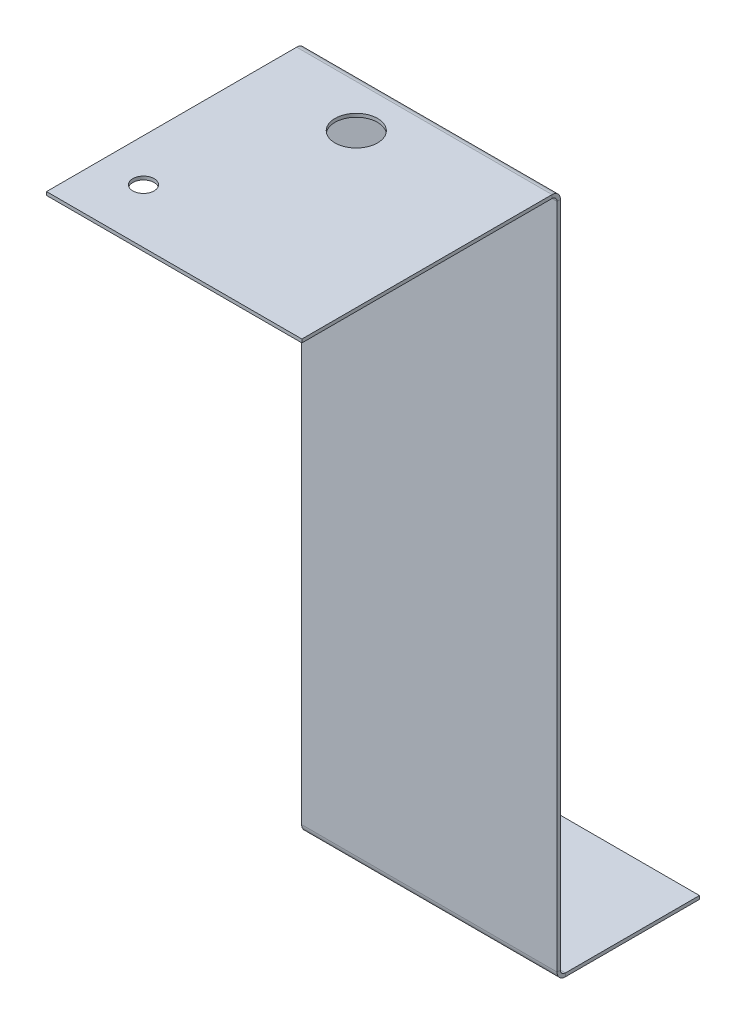
ISO-10303-21;
HEADER;
FILE_DESCRIPTION(('STEP AP214'),'2;1');
FILE_NAME('part.step','',(''),(''),'','','');
FILE_SCHEMA(('AUTOMOTIVE_DESIGN { 1 0 10303 214 1 1 1 1 }'));
ENDSEC;
DATA;
#1=APPLICATION_CONTEXT('core data for automotive mechanical design processes');
#2=APPLICATION_PROTOCOL_DEFINITION('international standard','automotive_design',2000,#1);
#3=PRODUCT_CONTEXT('',#1,'mechanical');
#4=PRODUCT('Part','Part','',(#3));
#5=PRODUCT_RELATED_PRODUCT_CATEGORY('part','',(#4));
#6=PRODUCT_DEFINITION_FORMATION('','',#4);
#7=PRODUCT_DEFINITION_CONTEXT('part definition',#1,'design');
#8=PRODUCT_DEFINITION('design','',#6,#7);
#9=PRODUCT_DEFINITION_SHAPE('','',#8);
#10=(LENGTH_UNIT() NAMED_UNIT(*) SI_UNIT(.MILLI.,.METRE.));
#11=(NAMED_UNIT(*) PLANE_ANGLE_UNIT() SI_UNIT($,.RADIAN.));
#12=(NAMED_UNIT(*) SI_UNIT($,.STERADIAN.) SOLID_ANGLE_UNIT());
#13=UNCERTAINTY_MEASURE_WITH_UNIT(LENGTH_MEASURE(1.E-05),#10,'distance_accuracy_value','');
#14=(GEOMETRIC_REPRESENTATION_CONTEXT(3) GLOBAL_UNCERTAINTY_ASSIGNED_CONTEXT((#13)) GLOBAL_UNIT_ASSIGNED_CONTEXT((#10,
#11,#12)) REPRESENTATION_CONTEXT('',''));
#15=CARTESIAN_POINT('',(0.,0.,0.));
#16=DIRECTION('',(0.,0.,1.));
#17=DIRECTION('',(1.,0.,0.));
#18=AXIS2_PLACEMENT_3D('',#15,#16,#17);
#19=CARTESIAN_POINT('',(38.1,0.,-0.508000000000008));
#20=DIRECTION('',(1.,0.,0.));
#21=DIRECTION('',(0.,1.,0.));
#22=AXIS2_PLACEMENT_3D('',#19,#20,#21);
#23=PLANE('',#22);
#24=DIRECTION('',(0.,1.,0.));
#25=VECTOR('',#24,1.);
#26=CARTESIAN_POINT('',(38.1,0.,0.));
#27=LINE('',#26,#25);
#28=CARTESIAN_POINT('',(38.1,-138.4554,0.));
#29=VERTEX_POINT('',#28);
#30=CARTESIAN_POINT('',(38.1,-38.8780154206615,0.));
#31=VERTEX_POINT('',#30);
#32=EDGE_CURVE('E290',#29,#31,#27,.T.);
#33=ORIENTED_EDGE('',*,*,#32,.F.);
#34=DIRECTION('',(0.,0.,-1.));
#35=VECTOR('',#34,1.);
#36=CARTESIAN_POINT('',(38.1,-138.4554,-0.508000000000952));
#37=LINE('',#36,#35);
#38=CARTESIAN_POINT('',(38.1,-138.4554,-0.508000000000008));
#39=VERTEX_POINT('',#38);
#40=EDGE_CURVE('E283',#29,#39,#37,.T.);
#41=ORIENTED_EDGE('',*,*,#40,.T.);
#42=DIRECTION('',(0.,1.,0.));
#43=VECTOR('',#42,1.);
#44=CARTESIAN_POINT('',(38.1,0.,-0.508000000000008));
#45=LINE('',#44,#43);
#46=CARTESIAN_POINT('',(38.1,-38.8780154206615,-0.508000000000008));
#47=VERTEX_POINT('',#46);
#48=EDGE_CURVE('E231',#39,#47,#45,.T.);
#49=ORIENTED_EDGE('',*,*,#48,.T.);
#50=DIRECTION('',(0.,0.,-1.));
#51=VECTOR('',#50,1.);
#52=CARTESIAN_POINT('',(38.1,-38.8780154206615,-0.508000000000286));
#53=LINE('',#52,#51);
#54=EDGE_CURVE('E232',#31,#47,#53,.T.);
#55=ORIENTED_EDGE('',*,*,#54,.F.);
#56=EDGE_LOOP('',(#33,#41,#49,#55));
#57=FACE_BOUND('',#56,.T.);
#58=ADVANCED_FACE('F64',(#57),#23,.T.);
#59=CARTESIAN_POINT('',(0.,0.,0.));
#60=DIRECTION('',(0.,0.,1.));
#61=DIRECTION('',(1.,0.,0.));
#62=AXIS2_PLACEMENT_3D('',#59,#60,#61);
#63=PLANE('',#62);
#64=DIRECTION('',(0.,-1.,0.));
#65=VECTOR('',#64,1.);
#66=CARTESIAN_POINT('',(0.,0.,0.));
#67=LINE('',#66,#65);
#68=CARTESIAN_POINT('',(0.,-38.8780154206615,0.));
#69=VERTEX_POINT('',#68);
#70=CARTESIAN_POINT('',(0.,-138.4554,0.));
#71=VERTEX_POINT('',#70);
#72=EDGE_CURVE('E293',#69,#71,#67,.T.);
#73=ORIENTED_EDGE('',*,*,#72,.T.);
#74=DIRECTION('',(1.,0.,0.));
#75=VECTOR('',#74,1.);
#76=CARTESIAN_POINT('',(1.11022302462516E-13,-138.4554,0.));
#77=LINE('',#76,#75);
#78=EDGE_CURVE('E73',#71,#29,#77,.T.);
#79=ORIENTED_EDGE('',*,*,#78,.T.);
#80=ORIENTED_EDGE('',*,*,#32,.T.);
#81=DIRECTION('',(1.,0.,0.));
#82=VECTOR('',#81,1.);
#83=CARTESIAN_POINT('',(0.,-38.8780154206615,0.));
#84=LINE('',#83,#82);
#85=EDGE_CURVE('E236',#69,#31,#84,.T.);
#86=ORIENTED_EDGE('',*,*,#85,.F.);
#87=EDGE_LOOP('',(#73,#79,#80,#86));
#88=FACE_BOUND('',#87,.T.);
#89=ADVANCED_FACE('F347',(#88),#63,.T.);
#90=CARTESIAN_POINT('',(0.,0.,-0.508000000000008));
#91=DIRECTION('',(-1.,0.,0.));
#92=DIRECTION('',(0.,-1.,0.));
#93=AXIS2_PLACEMENT_3D('',#90,#91,#92);
#94=PLANE('',#93);
#95=DIRECTION('',(0.,-1.,0.));
#96=VECTOR('',#95,1.);
#97=CARTESIAN_POINT('',(0.,0.,-0.508000000000008));
#98=LINE('',#97,#96);
#99=CARTESIAN_POINT('',(0.,-38.8780154206615,-0.508000000000008));
#100=VERTEX_POINT('',#99);
#101=CARTESIAN_POINT('',(0.,-138.4554,-0.508000000000008));
#102=VERTEX_POINT('',#101);
#103=EDGE_CURVE('E279',#100,#102,#98,.T.);
#104=ORIENTED_EDGE('',*,*,#103,.T.);
#105=DIRECTION('',(0.,0.,1.));
#106=VECTOR('',#105,1.);
#107=CARTESIAN_POINT('',(0.,-138.4554,-0.508000000000952));
#108=LINE('',#107,#106);
#109=EDGE_CURVE('E14',#102,#71,#108,.T.);
#110=ORIENTED_EDGE('',*,*,#109,.T.);
#111=ORIENTED_EDGE('',*,*,#72,.F.);
#112=DIRECTION('',(0.,0.,1.));
#113=VECTOR('',#112,1.);
#114=CARTESIAN_POINT('',(0.,-38.8780154206615,-0.508000000000286));
#115=LINE('',#114,#113);
#116=EDGE_CURVE('E221',#100,#69,#115,.T.);
#117=ORIENTED_EDGE('',*,*,#116,.F.);
#118=EDGE_LOOP('',(#104,#110,#111,#117));
#119=FACE_BOUND('',#118,.T.);
#120=ADVANCED_FACE('F66',(#119),#94,.T.);
#121=CARTESIAN_POINT('',(0.,-37.6334154206616,38.0585845793386));
#122=DIRECTION('',(-1.,0.,0.));
#123=DIRECTION('',(0.,0.,-1.));
#124=AXIS2_PLACEMENT_3D('',#121,#122,#123);
#125=PLANE('',#124);
#126=DIRECTION('',(0.,0.,-1.));
#127=VECTOR('',#126,1.);
#128=CARTESIAN_POINT('',(0.,-37.6334154206616,38.0585845793386));
#129=LINE('',#128,#127);
#130=CARTESIAN_POINT('',(0.,-37.6334154206616,38.0585845793386));
#131=VERTEX_POINT('',#130);
#132=CARTESIAN_POINT('',(0.,-37.6334154206615,0.736599999999976));
#133=VERTEX_POINT('',#132);
#134=EDGE_CURVE('E251',#131,#133,#129,.T.);
#135=ORIENTED_EDGE('',*,*,#134,.T.);
#136=DIRECTION('',(0.,-1.,0.));
#137=VECTOR('',#136,1.);
#138=CARTESIAN_POINT('',(0.,-37.6334154206613,0.736599999999976));
#139=LINE('',#138,#137);
#140=CARTESIAN_POINT('',(0.,-38.1414154206615,0.736599999999976));
#141=VERTEX_POINT('',#140);
#142=EDGE_CURVE('E269',#133,#141,#139,.T.);
#143=ORIENTED_EDGE('',*,*,#142,.T.);
#144=DIRECTION('',(0.,0.,-1.));
#145=VECTOR('',#144,1.);
#146=CARTESIAN_POINT('',(0.,-38.1414154206617,38.0585845793386));
#147=LINE('',#146,#145);
#148=CARTESIAN_POINT('',(0.,-38.1414154206617,38.0585845793386));
#149=VERTEX_POINT('',#148);
#150=EDGE_CURVE('E89',#149,#141,#147,.T.);
#151=ORIENTED_EDGE('',*,*,#150,.F.);
#152=DIRECTION('',(0.,-1.,0.));
#153=VECTOR('',#152,1.);
#154=CARTESIAN_POINT('',(0.,-37.6334154206616,38.0585845793386));
#155=LINE('',#154,#153);
#156=EDGE_CURVE('E253',#131,#149,#155,.T.);
#157=ORIENTED_EDGE('',*,*,#156,.F.);
#158=EDGE_LOOP('',(#135,#143,#151,#157));
#159=FACE_BOUND('',#158,.T.);
#160=ADVANCED_FACE('F320',(#159),#125,.T.);
#161=CARTESIAN_POINT('',(38.1000000000001,-37.6334154206616,38.0585845793386));
#162=DIRECTION('',(1.,0.,0.));
#163=DIRECTION('',(0.,0.,1.));
#164=AXIS2_PLACEMENT_3D('',#161,#162,#163);
#165=PLANE('',#164);
#166=DIRECTION('',(0.,0.,1.));
#167=VECTOR('',#166,1.);
#168=CARTESIAN_POINT('',(38.1000000000001,-38.1414154206617,38.0585845793386));
#169=LINE('',#168,#167);
#170=CARTESIAN_POINT('',(38.1,-38.1414154206615,0.736599999999976));
#171=VERTEX_POINT('',#170);
#172=CARTESIAN_POINT('',(38.1000000000001,-38.1414154206617,38.0585845793386));
#173=VERTEX_POINT('',#172);
#174=EDGE_CURVE('E252',#171,#173,#169,.T.);
#175=ORIENTED_EDGE('',*,*,#174,.F.);
#176=DIRECTION('',(0.,1.,0.));
#177=VECTOR('',#176,1.);
#178=CARTESIAN_POINT('',(38.1,-37.6334154206613,0.736599999999976));
#179=LINE('',#178,#177);
#180=CARTESIAN_POINT('',(38.1,-37.6334154206615,0.736599999999976));
#181=VERTEX_POINT('',#180);
#182=EDGE_CURVE('E263',#171,#181,#179,.T.);
#183=ORIENTED_EDGE('',*,*,#182,.T.);
#184=DIRECTION('',(0.,0.,1.));
#185=VECTOR('',#184,1.);
#186=CARTESIAN_POINT('',(38.1000000000001,-37.6334154206616,38.0585845793386));
#187=LINE('',#186,#185);
#188=CARTESIAN_POINT('',(38.1000000000001,-37.6334154206616,38.0585845793386));
#189=VERTEX_POINT('',#188);
#190=EDGE_CURVE('E247',#181,#189,#187,.T.);
#191=ORIENTED_EDGE('',*,*,#190,.T.);
#192=DIRECTION('',(0.,-1.,0.));
#193=VECTOR('',#192,1.);
#194=CARTESIAN_POINT('',(38.1000000000001,-37.6334154206616,38.0585845793386));
#195=LINE('',#194,#193);
#196=EDGE_CURVE('E246',#189,#173,#195,.T.);
#197=ORIENTED_EDGE('',*,*,#196,.T.);
#198=EDGE_LOOP('',(#175,#183,#191,#197));
#199=FACE_BOUND('',#198,.T.);
#200=ADVANCED_FACE('F330',(#199),#165,.T.);
#201=CARTESIAN_POINT('',(0.,-38.1414154206617,38.0585845793386));
#202=DIRECTION('',(0.,-1.,0.));
#203=DIRECTION('',(1.,0.,0.));
#204=AXIS2_PLACEMENT_3D('',#201,#202,#203);
#205=PLANE('',#204);
#206=CARTESIAN_POINT('',(15.24,-38.1414154206615,7.0866));
#207=DIRECTION('',(0.,-1.,0.));
#208=DIRECTION('',(0.,0.,-1.));
#209=AXIS2_PLACEMENT_3D('',#206,#207,#208);
#210=CIRCLE('',#209,3.175);
#211=CARTESIAN_POINT('',(15.24,-38.1414154206615,3.9116));
#212=VERTEX_POINT('',#211);
#213=EDGE_CURVE('E517',#212,#212,#210,.T.);
#214=ORIENTED_EDGE('',*,*,#213,.F.);
#215=EDGE_LOOP('',(#214));
#216=FACE_BOUND('',#215,.T.);
#217=CARTESIAN_POINT('',(6.35000000000002,-38.1414154206616,29.9466000000001));
#218=DIRECTION('',(0.,-1.,0.));
#219=DIRECTION('',(0.,0.,-1.));
#220=AXIS2_PLACEMENT_3D('',#217,#218,#219);
#221=CIRCLE('',#220,1.58749999999999);
#222=CARTESIAN_POINT('',(6.35000000000002,-38.1414154206616,28.3591000000001));
#223=VERTEX_POINT('',#222);
#224=EDGE_CURVE('E526',#223,#223,#221,.T.);
#225=ORIENTED_EDGE('',*,*,#224,.F.);
#226=EDGE_LOOP('',(#225));
#227=FACE_BOUND('',#226,.T.);
#228=ORIENTED_EDGE('',*,*,#150,.T.);
#229=DIRECTION('',(1.,0.,0.));
#230=VECTOR('',#229,1.);
#231=CARTESIAN_POINT('',(0.,-38.1414154206615,0.736599999999976));
#232=LINE('',#231,#230);
#233=EDGE_CURVE('E266',#141,#171,#232,.T.);
#234=ORIENTED_EDGE('',*,*,#233,.T.);
#235=ORIENTED_EDGE('',*,*,#174,.T.);
#236=DIRECTION('',(-1.,0.,0.));
#237=VECTOR('',#236,1.);
#238=CARTESIAN_POINT('',(0.,-38.1414154206617,38.0585845793386));
#239=LINE('',#238,#237);
#240=EDGE_CURVE('E248',#173,#149,#239,.T.);
#241=ORIENTED_EDGE('',*,*,#240,.T.);
#242=EDGE_LOOP('',(#228,#234,#235,#241));
#243=FACE_BOUND('',#242,.T.);
#244=ADVANCED_FACE('F328',(#216,#227,#243),#205,.T.);
#245=CARTESIAN_POINT('',(0.,-37.6334154206616,38.0585845793386));
#246=DIRECTION('',(0.,0.,1.));
#247=DIRECTION('',(0.,-1.,0.));
#248=AXIS2_PLACEMENT_3D('',#245,#246,#247);
#249=PLANE('',#248);
#250=ORIENTED_EDGE('',*,*,#240,.F.);
#251=ORIENTED_EDGE('',*,*,#196,.F.);
#252=DIRECTION('',(-1.,0.,0.));
#253=VECTOR('',#252,1.);
#254=CARTESIAN_POINT('',(0.,-37.6334154206616,38.0585845793386));
#255=LINE('',#254,#253);
#256=EDGE_CURVE('E242',#189,#131,#255,.T.);
#257=ORIENTED_EDGE('',*,*,#256,.T.);
#258=ORIENTED_EDGE('',*,*,#156,.T.);
#259=EDGE_LOOP('',(#250,#251,#257,#258));
#260=FACE_BOUND('',#259,.T.);
#261=ADVANCED_FACE('F334',(#260),#249,.T.);
#262=CARTESIAN_POINT('',(0.,-37.6334154206616,38.0585845793386));
#263=DIRECTION('',(0.,-1.,0.));
#264=DIRECTION('',(1.,0.,0.));
#265=AXIS2_PLACEMENT_3D('',#262,#263,#264);
#266=PLANE('',#265);
#267=CARTESIAN_POINT('',(15.24,-37.6334154206614,7.0866));
#268=DIRECTION('',(0.,-1.,0.));
#269=DIRECTION('',(0.,0.,-1.));
#270=AXIS2_PLACEMENT_3D('',#267,#268,#269);
#271=CIRCLE('',#270,3.175);
#272=CARTESIAN_POINT('',(15.24,-37.6334154206614,3.9116));
#273=VERTEX_POINT('',#272);
#274=EDGE_CURVE('E514',#273,#273,#271,.T.);
#275=ORIENTED_EDGE('',*,*,#274,.T.);
#276=EDGE_LOOP('',(#275));
#277=FACE_BOUND('',#276,.T.);
#278=CARTESIAN_POINT('',(6.35000000000002,-37.6334154206615,29.9466000000001));
#279=DIRECTION('',(0.,-1.,0.));
#280=DIRECTION('',(0.,0.,-1.));
#281=AXIS2_PLACEMENT_3D('',#278,#279,#280);
#282=CIRCLE('',#281,1.5875);
#283=CARTESIAN_POINT('',(6.35000000000002,-37.6334154206615,28.3591000000001));
#284=VERTEX_POINT('',#283);
#285=EDGE_CURVE('E201',#284,#284,#282,.T.);
#286=ORIENTED_EDGE('',*,*,#285,.T.);
#287=EDGE_LOOP('',(#286));
#288=FACE_BOUND('',#287,.T.);
#289=DIRECTION('',(1.,0.,0.));
#290=VECTOR('',#289,1.);
#291=CARTESIAN_POINT('',(0.,-37.6334154206615,0.736599999999976));
#292=LINE('',#291,#290);
#293=EDGE_CURVE('E256',#133,#181,#292,.T.);
#294=ORIENTED_EDGE('',*,*,#293,.F.);
#295=ORIENTED_EDGE('',*,*,#134,.F.);
#296=ORIENTED_EDGE('',*,*,#256,.F.);
#297=ORIENTED_EDGE('',*,*,#190,.F.);
#298=EDGE_LOOP('',(#294,#295,#296,#297));
#299=FACE_BOUND('',#298,.T.);
#300=ADVANCED_FACE('F316',(#277,#288,#299),#266,.F.);
#301=CARTESIAN_POINT('',(0.,0.,-0.508000000000008));
#302=DIRECTION('',(0.,0.,1.));
#303=DIRECTION('',(1.,0.,0.));
#304=AXIS2_PLACEMENT_3D('',#301,#302,#303);
#305=PLANE('',#304);
#306=DIRECTION('',(1.,0.,0.));
#307=VECTOR('',#306,1.);
#308=CARTESIAN_POINT('',(1.11022302462516E-13,-138.4554,-0.508000000000008));
#309=LINE('',#308,#307);
#310=EDGE_CURVE('E271',#102,#39,#309,.T.);
#311=ORIENTED_EDGE('',*,*,#310,.F.);
#312=ORIENTED_EDGE('',*,*,#103,.F.);
#313=DIRECTION('',(1.,0.,0.));
#314=VECTOR('',#313,1.);
#315=CARTESIAN_POINT('',(0.,-38.8780154206615,-0.508000000000008));
#316=LINE('',#315,#314);
#317=EDGE_CURVE('E227',#100,#47,#316,.T.);
#318=ORIENTED_EDGE('',*,*,#317,.T.);
#319=ORIENTED_EDGE('',*,*,#48,.F.);
#320=EDGE_LOOP('',(#311,#312,#318,#319));
#321=FACE_BOUND('',#320,.T.);
#322=ADVANCED_FACE('F303',(#321),#305,.F.);
#323=CARTESIAN_POINT('',(0.,-38.8780154206615,0.736599999999976));
#324=DIRECTION('',(-1.,0.,0.));
#325=DIRECTION('',(0.,-1.,0.));
#326=AXIS2_PLACEMENT_3D('',#323,#324,#325);
#327=PLANE('',#326);
#328=ORIENTED_EDGE('',*,*,#116,.T.);
#329=CARTESIAN_POINT('',(0.,-38.8780154206615,0.736599999999976));
#330=DIRECTION('',(1.,0.,0.));
#331=DIRECTION('',(0.,1.,0.));
#332=AXIS2_PLACEMENT_3D('',#329,#330,#331);
#333=CIRCLE('',#332,0.7366);
#334=EDGE_CURVE('E209',#69,#141,#333,.T.);
#335=ORIENTED_EDGE('',*,*,#334,.T.);
#336=ORIENTED_EDGE('',*,*,#142,.F.);
#337=CARTESIAN_POINT('',(0.,-38.8780154206615,0.736599999999976));
#338=DIRECTION('',(1.,0.,0.));
#339=DIRECTION('',(0.,-1.,0.));
#340=AXIS2_PLACEMENT_3D('',#337,#338,#339);
#341=CIRCLE('',#340,1.2446);
#342=EDGE_CURVE('E213',#100,#133,#341,.T.);
#343=ORIENTED_EDGE('',*,*,#342,.F.);
#344=EDGE_LOOP('',(#328,#335,#336,#343));
#345=FACE_BOUND('',#344,.T.);
#346=ADVANCED_FACE('F323',(#345),#327,.T.);
#347=CARTESIAN_POINT('',(38.1,-38.8780154206615,0.736599999999976));
#348=DIRECTION('',(1.,0.,0.));
#349=DIRECTION('',(0.,0.,-1.));
#350=AXIS2_PLACEMENT_3D('',#347,#348,#349);
#351=PLANE('',#350);
#352=ORIENTED_EDGE('',*,*,#182,.F.);
#353=CARTESIAN_POINT('',(38.1,-38.8780154206615,0.736599999999976));
#354=DIRECTION('',(1.,0.,0.));
#355=DIRECTION('',(0.,1.,0.));
#356=AXIS2_PLACEMENT_3D('',#353,#354,#355);
#357=CIRCLE('',#356,0.7366);
#358=EDGE_CURVE('E217',#171,#31,#357,.F.);
#359=ORIENTED_EDGE('',*,*,#358,.T.);
#360=ORIENTED_EDGE('',*,*,#54,.T.);
#361=CARTESIAN_POINT('',(38.1,-38.8780154206615,0.736599999999976));
#362=DIRECTION('',(-1.,0.,0.));
#363=DIRECTION('',(0.,0.,-1.));
#364=AXIS2_PLACEMENT_3D('',#361,#362,#363);
#365=CIRCLE('',#364,1.2446);
#366=EDGE_CURVE('E216',#181,#47,#365,.T.);
#367=ORIENTED_EDGE('',*,*,#366,.F.);
#368=EDGE_LOOP('',(#352,#359,#360,#367));
#369=FACE_BOUND('',#368,.T.);
#370=ADVANCED_FACE('F309',(#369),#351,.T.);
#371=CARTESIAN_POINT('',(-19.0851451548194,-38.8780154206615,0.736600000000032));
#372=DIRECTION('',(1.,0.,0.));
#373=DIRECTION('',(0.,1.,0.));
#374=AXIS2_PLACEMENT_3D('',#371,#372,#373);
#375=CYLINDRICAL_SURFACE('',#374,1.2446);
#376=ORIENTED_EDGE('',*,*,#366,.T.);
#377=ORIENTED_EDGE('',*,*,#317,.F.);
#378=ORIENTED_EDGE('',*,*,#342,.T.);
#379=ORIENTED_EDGE('',*,*,#293,.T.);
#380=EDGE_LOOP('',(#376,#377,#378,#379));
#381=FACE_BOUND('',#380,.T.);
#382=ADVANCED_FACE('F311',(#381),#375,.T.);
#383=CARTESIAN_POINT('',(-19.0851451548194,-38.8780154206615,0.736600000000032));
#384=DIRECTION('',(1.,0.,0.));
#385=DIRECTION('',(0.,1.,0.));
#386=AXIS2_PLACEMENT_3D('',#383,#384,#385);
#387=CYLINDRICAL_SURFACE('',#386,0.7366);
#388=ORIENTED_EDGE('',*,*,#358,.F.);
#389=ORIENTED_EDGE('',*,*,#233,.F.);
#390=ORIENTED_EDGE('',*,*,#334,.F.);
#391=ORIENTED_EDGE('',*,*,#85,.T.);
#392=EDGE_LOOP('',(#388,#389,#390,#391));
#393=FACE_BOUND('',#392,.T.);
#394=ADVANCED_FACE('F326',(#393),#387,.F.);
#395=CARTESIAN_POINT('',(0.,-138.4554,-1.24459999999998));
#396=DIRECTION('',(1.,0.,0.));
#397=DIRECTION('',(0.,1.,0.));
#398=AXIS2_PLACEMENT_3D('',#395,#396,#397);
#399=PLANE('',#398);
#400=DIRECTION('',(0.,-1.,0.));
#401=VECTOR('',#400,1.);
#402=CARTESIAN_POINT('',(0.,-139.191999999999,-1.24459999999998));
#403=LINE('',#402,#401);
#404=CARTESIAN_POINT('',(0.,-139.192,-1.24459999999998));
#405=VERTEX_POINT('',#404);
#406=CARTESIAN_POINT('',(0.,-139.7,-1.24459999999998));
#407=VERTEX_POINT('',#406);
#408=EDGE_CURVE('E171',#405,#407,#403,.T.);
#409=ORIENTED_EDGE('',*,*,#408,.T.);
#410=CARTESIAN_POINT('',(0.,-138.4554,-1.24459999999998));
#411=DIRECTION('',(-1.,0.,0.));
#412=DIRECTION('',(0.,-1.,0.));
#413=AXIS2_PLACEMENT_3D('',#410,#411,#412);
#414=CIRCLE('',#413,1.2446);
#415=EDGE_CURVE('E81',#407,#71,#414,.T.);
#416=ORIENTED_EDGE('',*,*,#415,.T.);
#417=ORIENTED_EDGE('',*,*,#109,.F.);
#418=CARTESIAN_POINT('',(0.,-138.4554,-1.24459999999998));
#419=DIRECTION('',(-1.,0.,0.));
#420=DIRECTION('',(0.,1.,0.));
#421=AXIS2_PLACEMENT_3D('',#418,#419,#420);
#422=CIRCLE('',#421,0.736600000000016);
#423=EDGE_CURVE('E202',#405,#102,#422,.T.);
#424=ORIENTED_EDGE('',*,*,#423,.F.);
#425=EDGE_LOOP('',(#409,#416,#417,#424));
#426=FACE_BOUND('',#425,.T.);
#427=ADVANCED_FACE('F408',(#426),#399,.F.);
#428=CARTESIAN_POINT('',(38.1,-138.4554,-1.24459999999998));
#429=DIRECTION('',(-1.,0.,0.));
#430=DIRECTION('',(0.,0.,1.));
#431=AXIS2_PLACEMENT_3D('',#428,#429,#430);
#432=PLANE('',#431);
#433=ORIENTED_EDGE('',*,*,#40,.F.);
#434=CARTESIAN_POINT('',(38.1,-138.4554,-1.24459999999998));
#435=DIRECTION('',(-1.,0.,0.));
#436=DIRECTION('',(0.,-1.,0.));
#437=AXIS2_PLACEMENT_3D('',#434,#435,#436);
#438=CIRCLE('',#437,1.2446);
#439=CARTESIAN_POINT('',(38.1,-139.7,-1.24460000000004));
#440=VERTEX_POINT('',#439);
#441=EDGE_CURVE('E206',#29,#440,#438,.F.);
#442=ORIENTED_EDGE('',*,*,#441,.T.);
#443=DIRECTION('',(0.,1.,0.));
#444=VECTOR('',#443,1.);
#445=CARTESIAN_POINT('',(38.1,-139.191999999999,-1.24460000000004));
#446=LINE('',#445,#444);
#447=CARTESIAN_POINT('',(38.1,-139.192,-1.24460000000004));
#448=VERTEX_POINT('',#447);
#449=EDGE_CURVE('E189',#440,#448,#446,.T.);
#450=ORIENTED_EDGE('',*,*,#449,.T.);
#451=CARTESIAN_POINT('',(38.1,-138.4554,-1.24459999999998));
#452=DIRECTION('',(1.,0.,0.));
#453=DIRECTION('',(0.,0.,1.));
#454=AXIS2_PLACEMENT_3D('',#451,#452,#453);
#455=CIRCLE('',#454,0.736600000000016);
#456=EDGE_CURVE('E205',#39,#448,#455,.T.);
#457=ORIENTED_EDGE('',*,*,#456,.F.);
#458=EDGE_LOOP('',(#433,#442,#450,#457));
#459=FACE_BOUND('',#458,.T.);
#460=ADVANCED_FACE('F417',(#459),#432,.F.);
#461=CARTESIAN_POINT('',(57.1851451548195,-138.4554,-1.24459999999987));
#462=DIRECTION('',(-1.,0.,0.));
#463=DIRECTION('',(0.,-1.,0.));
#464=AXIS2_PLACEMENT_3D('',#461,#462,#463);
#465=CYLINDRICAL_SURFACE('',#464,0.7366);
#466=ORIENTED_EDGE('',*,*,#456,.T.);
#467=DIRECTION('',(1.,0.,0.));
#468=VECTOR('',#467,1.);
#469=CARTESIAN_POINT('',(1.11022302462516E-13,-139.192,-1.24459999999998));
#470=LINE('',#469,#468);
#471=EDGE_CURVE('E191',#405,#448,#470,.T.);
#472=ORIENTED_EDGE('',*,*,#471,.F.);
#473=ORIENTED_EDGE('',*,*,#423,.T.);
#474=ORIENTED_EDGE('',*,*,#310,.T.);
#475=EDGE_LOOP('',(#466,#472,#473,#474));
#476=FACE_BOUND('',#475,.T.);
#477=ADVANCED_FACE('F426',(#476),#465,.F.);
#478=CARTESIAN_POINT('',(57.1851451548195,-138.4554,-1.24459999999987));
#479=DIRECTION('',(-1.,0.,0.));
#480=DIRECTION('',(0.,-1.,0.));
#481=AXIS2_PLACEMENT_3D('',#478,#479,#480);
#482=CYLINDRICAL_SURFACE('',#481,1.2446);
#483=ORIENTED_EDGE('',*,*,#441,.F.);
#484=ORIENTED_EDGE('',*,*,#78,.F.);
#485=ORIENTED_EDGE('',*,*,#415,.F.);
#486=DIRECTION('',(1.,0.,0.));
#487=VECTOR('',#486,1.);
#488=CARTESIAN_POINT('',(1.11022302462516E-13,-139.7,-1.24459999999998));
#489=LINE('',#488,#487);
#490=EDGE_CURVE('E194',#407,#440,#489,.T.);
#491=ORIENTED_EDGE('',*,*,#490,.T.);
#492=EDGE_LOOP('',(#483,#484,#485,#491));
#493=FACE_BOUND('',#492,.T.);
#494=ADVANCED_FACE('F435',(#493),#482,.T.);
#495=CARTESIAN_POINT('',(0.,-139.192,-21.253169158677));
#496=DIRECTION('',(0.,0.,-1.));
#497=DIRECTION('',(0.,1.,0.));
#498=AXIS2_PLACEMENT_3D('',#495,#496,#497);
#499=PLANE('',#498);
#500=DIRECTION('',(1.,0.,0.));
#501=VECTOR('',#500,1.);
#502=CARTESIAN_POINT('',(0.,-139.7,-21.253169158677));
#503=LINE('',#502,#501);
#504=CARTESIAN_POINT('',(0.,-139.7,-21.253169158677));
#505=VERTEX_POINT('',#504);
#506=CARTESIAN_POINT('',(38.1000000000001,-139.7,-21.253169158677));
#507=VERTEX_POINT('',#506);
#508=EDGE_CURVE('E183',#505,#507,#503,.T.);
#509=ORIENTED_EDGE('',*,*,#508,.F.);
#510=DIRECTION('',(0.,-1.,0.));
#511=VECTOR('',#510,1.);
#512=CARTESIAN_POINT('',(0.,-139.192,-21.253169158677));
#513=LINE('',#512,#511);
#514=CARTESIAN_POINT('',(0.,-139.192,-21.253169158677));
#515=VERTEX_POINT('',#514);
#516=EDGE_CURVE('E169',#515,#505,#513,.T.);
#517=ORIENTED_EDGE('',*,*,#516,.F.);
#518=DIRECTION('',(1.,0.,0.));
#519=VECTOR('',#518,1.);
#520=CARTESIAN_POINT('',(0.,-139.192,-21.253169158677));
#521=LINE('',#520,#519);
#522=CARTESIAN_POINT('',(38.1000000000001,-139.192,-21.253169158677));
#523=VERTEX_POINT('',#522);
#524=EDGE_CURVE('E181',#515,#523,#521,.T.);
#525=ORIENTED_EDGE('',*,*,#524,.T.);
#526=DIRECTION('',(0.,-1.,0.));
#527=VECTOR('',#526,1.);
#528=CARTESIAN_POINT('',(38.1000000000001,-139.192,-21.253169158677));
#529=LINE('',#528,#527);
#530=EDGE_CURVE('E188',#523,#507,#529,.T.);
#531=ORIENTED_EDGE('',*,*,#530,.T.);
#532=EDGE_LOOP('',(#509,#517,#525,#531));
#533=FACE_BOUND('',#532,.T.);
#534=ADVANCED_FACE('F180',(#533),#499,.T.);
#535=CARTESIAN_POINT('',(1.11022302462516E-13,-139.192000000001,138.766830841323));
#536=DIRECTION('',(0.,-1.,0.));
#537=DIRECTION('',(1.,0.,0.));
#538=AXIS2_PLACEMENT_3D('',#535,#536,#537);
#539=PLANE('',#538);
#540=CARTESIAN_POINT('',(19.05,-139.192,-11.2488845793384));
#541=DIRECTION('',(0.,-1.,0.));
#542=DIRECTION('',(0.,0.,-1.));
#543=AXIS2_PLACEMENT_3D('',#540,#541,#542);
#544=CIRCLE('',#543,3.17499999999999);
#545=CARTESIAN_POINT('',(19.05,-139.192,-14.4238845793384));
#546=VERTEX_POINT('',#545);
#547=EDGE_CURVE('E68',#546,#546,#544,.T.);
#548=ORIENTED_EDGE('',*,*,#547,.T.);
#549=EDGE_LOOP('',(#548));
#550=FACE_BOUND('',#549,.T.);
#551=DIRECTION('',(0.,0.,-1.));
#552=VECTOR('',#551,1.);
#553=CARTESIAN_POINT('',(1.11022302462516E-13,-139.192000000001,138.766830841323));
#554=LINE('',#553,#552);
#555=EDGE_CURVE('E166',#405,#515,#554,.T.);
#556=ORIENTED_EDGE('',*,*,#555,.F.);
#557=ORIENTED_EDGE('',*,*,#471,.T.);
#558=DIRECTION('',(0.,0.,1.));
#559=VECTOR('',#558,1.);
#560=CARTESIAN_POINT('',(38.1000000000001,-139.192,138.766830841323));
#561=LINE('',#560,#559);
#562=EDGE_CURVE('E187',#523,#448,#561,.T.);
#563=ORIENTED_EDGE('',*,*,#562,.F.);
#564=ORIENTED_EDGE('',*,*,#524,.F.);
#565=EDGE_LOOP('',(#556,#557,#563,#564));
#566=FACE_BOUND('',#565,.T.);
#567=ADVANCED_FACE('F186',(#550,#566),#539,.F.);
#568=CARTESIAN_POINT('',(38.1000000000001,-139.192,138.766830841323));
#569=DIRECTION('',(1.,0.,0.));
#570=DIRECTION('',(0.,0.,1.));
#571=AXIS2_PLACEMENT_3D('',#568,#569,#570);
#572=PLANE('',#571);
#573=ORIENTED_EDGE('',*,*,#449,.F.);
#574=DIRECTION('',(0.,0.,1.));
#575=VECTOR('',#574,1.);
#576=CARTESIAN_POINT('',(38.1000000000001,-139.700000000001,138.766830841323));
#577=LINE('',#576,#575);
#578=EDGE_CURVE('E176',#507,#440,#577,.T.);
#579=ORIENTED_EDGE('',*,*,#578,.F.);
#580=ORIENTED_EDGE('',*,*,#530,.F.);
#581=ORIENTED_EDGE('',*,*,#562,.T.);
#582=EDGE_LOOP('',(#573,#579,#580,#581));
#583=FACE_BOUND('',#582,.T.);
#584=ADVANCED_FACE('F460',(#583),#572,.T.);
#585=CARTESIAN_POINT('',(1.11022302462516E-13,-139.700000000001,138.766830841323));
#586=DIRECTION('',(0.,-1.,0.));
#587=DIRECTION('',(1.,0.,0.));
#588=AXIS2_PLACEMENT_3D('',#585,#586,#587);
#589=PLANE('',#588);
#590=CARTESIAN_POINT('',(19.05,-139.7,-11.2488845793384));
#591=DIRECTION('',(0.,-1.,0.));
#592=DIRECTION('',(0.,0.,-1.));
#593=AXIS2_PLACEMENT_3D('',#590,#591,#592);
#594=CIRCLE('',#593,3.175);
#595=CARTESIAN_POINT('',(19.05,-139.7,-14.4238845793384));
#596=VERTEX_POINT('',#595);
#597=EDGE_CURVE('E521',#596,#596,#594,.T.);
#598=ORIENTED_EDGE('',*,*,#597,.F.);
#599=EDGE_LOOP('',(#598));
#600=FACE_BOUND('',#599,.T.);
#601=ORIENTED_EDGE('',*,*,#490,.F.);
#602=DIRECTION('',(0.,0.,-1.));
#603=VECTOR('',#602,1.);
#604=CARTESIAN_POINT('',(1.11022302462516E-13,-139.700000000001,138.766830841323));
#605=LINE('',#604,#603);
#606=EDGE_CURVE('E535',#407,#505,#605,.T.);
#607=ORIENTED_EDGE('',*,*,#606,.T.);
#608=ORIENTED_EDGE('',*,*,#508,.T.);
#609=ORIENTED_EDGE('',*,*,#578,.T.);
#610=EDGE_LOOP('',(#601,#607,#608,#609));
#611=FACE_BOUND('',#610,.T.);
#612=ADVANCED_FACE('F469',(#600,#611),#589,.T.);
#613=CARTESIAN_POINT('',(1.11022302462516E-13,-139.192000000001,138.766830841323));
#614=DIRECTION('',(-1.,0.,0.));
#615=DIRECTION('',(0.,0.,-1.));
#616=AXIS2_PLACEMENT_3D('',#613,#614,#615);
#617=PLANE('',#616);
#618=ORIENTED_EDGE('',*,*,#408,.F.);
#619=ORIENTED_EDGE('',*,*,#555,.T.);
#620=ORIENTED_EDGE('',*,*,#516,.T.);
#621=ORIENTED_EDGE('',*,*,#606,.F.);
#622=EDGE_LOOP('',(#618,#619,#620,#621));
#623=FACE_BOUND('',#622,.T.);
#624=ADVANCED_FACE('F168',(#623),#617,.T.);
#625=CARTESIAN_POINT('',(6.35000000000002,-38.1414154206616,29.9466000000001));
#626=DIRECTION('',(0.,-1.,0.));
#627=DIRECTION('',(0.,0.,-1.));
#628=AXIS2_PLACEMENT_3D('',#625,#626,#627);
#629=CYLINDRICAL_SURFACE('',#628,1.58749999999999);
#630=ORIENTED_EDGE('',*,*,#285,.F.);
#631=EDGE_LOOP('',(#630));
#632=FACE_BOUND('',#631,.T.);
#633=ORIENTED_EDGE('',*,*,#224,.T.);
#634=EDGE_LOOP('',(#633));
#635=FACE_BOUND('',#634,.T.);
#636=ADVANCED_FACE('F485',(#632,#635),#629,.F.);
#637=CARTESIAN_POINT('',(19.05,-139.7,-11.2488845793384));
#638=DIRECTION('',(0.,-1.,0.));
#639=DIRECTION('',(0.,0.,-1.));
#640=AXIS2_PLACEMENT_3D('',#637,#638,#639);
#641=CYLINDRICAL_SURFACE('',#640,3.17499999999999);
#642=ORIENTED_EDGE('',*,*,#597,.T.);
#643=EDGE_LOOP('',(#642));
#644=FACE_BOUND('',#643,.T.);
#645=ORIENTED_EDGE('',*,*,#547,.F.);
#646=EDGE_LOOP('',(#645));
#647=FACE_BOUND('',#646,.T.);
#648=ADVANCED_FACE('F492',(#644,#647),#641,.F.);
#649=CARTESIAN_POINT('',(15.24,-38.1414154206615,7.0866));
#650=DIRECTION('',(0.,-1.,0.));
#651=DIRECTION('',(0.,0.,-1.));
#652=AXIS2_PLACEMENT_3D('',#649,#650,#651);
#653=CYLINDRICAL_SURFACE('',#652,3.175);
#654=ORIENTED_EDGE('',*,*,#274,.F.);
#655=EDGE_LOOP('',(#654));
#656=FACE_BOUND('',#655,.T.);
#657=ORIENTED_EDGE('',*,*,#213,.T.);
#658=EDGE_LOOP('',(#657));
#659=FACE_BOUND('',#658,.T.);
#660=ADVANCED_FACE('F500',(#656,#659),#653,.F.);
#661=CLOSED_SHELL('',(#58,#89,#120,#160,#200,#244,#261,#300,#322,#346,#370,#382,#394,#427,#460,
#477,#494,#534,#567,#584,#612,#624,#636,#648,#660));
#662=MANIFOLD_SOLID_BREP('B2',#661);
#663=ADVANCED_BREP_SHAPE_REPRESENTATION('',(#18,#662),#14);
#664=SHAPE_DEFINITION_REPRESENTATION(#9,#663);
ENDSEC;
END-ISO-10303-21;
